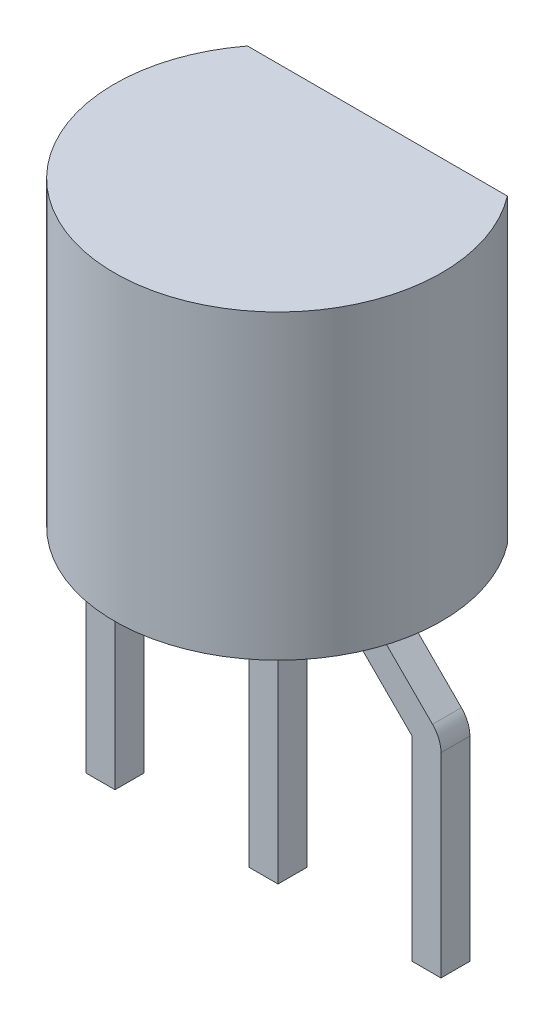
ISO-10303-21;
HEADER;
FILE_DESCRIPTION(('STEP AP214'),'2;1');
FILE_NAME('part.step','',(''),(''),'','','');
FILE_SCHEMA(('AUTOMOTIVE_DESIGN { 1 0 10303 214 1 1 1 1 }'));
ENDSEC;
DATA;
#1=APPLICATION_CONTEXT('core data for automotive mechanical design processes');
#2=APPLICATION_PROTOCOL_DEFINITION('international standard','automotive_design',2000,#1);
#3=PRODUCT_CONTEXT('',#1,'mechanical');
#4=PRODUCT('Part','Part','',(#3));
#5=PRODUCT_RELATED_PRODUCT_CATEGORY('part','',(#4));
#6=PRODUCT_DEFINITION_FORMATION('','',#4);
#7=PRODUCT_DEFINITION_CONTEXT('part definition',#1,'design');
#8=PRODUCT_DEFINITION('design','',#6,#7);
#9=PRODUCT_DEFINITION_SHAPE('','',#8);
#10=(LENGTH_UNIT() NAMED_UNIT(*) SI_UNIT(.MILLI.,.METRE.));
#11=(NAMED_UNIT(*) PLANE_ANGLE_UNIT() SI_UNIT($,.RADIAN.));
#12=(NAMED_UNIT(*) SI_UNIT($,.STERADIAN.) SOLID_ANGLE_UNIT());
#13=UNCERTAINTY_MEASURE_WITH_UNIT(LENGTH_MEASURE(1.E-05),#10,'distance_accuracy_value','');
#14=(GEOMETRIC_REPRESENTATION_CONTEXT(3) GLOBAL_UNCERTAINTY_ASSIGNED_CONTEXT((#13)) GLOBAL_UNIT_ASSIGNED_CONTEXT((#10,
#11,#12)) REPRESENTATION_CONTEXT('',''));
#15=CARTESIAN_POINT('',(0.,0.,0.));
#16=DIRECTION('',(0.,0.,1.));
#17=DIRECTION('',(1.,0.,0.));
#18=AXIS2_PLACEMENT_3D('',#15,#16,#17);
#19=CARTESIAN_POINT('',(0.,0.,0.));
#20=DIRECTION('',(0.,1.,0.));
#21=DIRECTION('',(1.,0.,0.));
#22=AXIS2_PLACEMENT_3D('',#19,#20,#21);
#23=PLANE('',#22);
#24=DIRECTION('',(0.,0.,1.));
#25=VECTOR('',#24,1.);
#26=CARTESIAN_POINT('',(-1.045,0.,0.225));
#27=LINE('',#26,#25);
#28=CARTESIAN_POINT('',(-1.045,0.,-0.225));
#29=VERTEX_POINT('',#28);
#30=CARTESIAN_POINT('',(-1.045,0.,0.225));
#31=VERTEX_POINT('',#30);
#32=EDGE_CURVE('E358',#29,#31,#27,.T.);
#33=ORIENTED_EDGE('',*,*,#32,.F.);
#34=DIRECTION('',(1.,0.,0.));
#35=VECTOR('',#34,1.);
#36=CARTESIAN_POINT('',(-1.495,0.,-0.225));
#37=LINE('',#36,#35);
#38=CARTESIAN_POINT('',(-1.495,0.,-0.225));
#39=VERTEX_POINT('',#38);
#40=EDGE_CURVE('E363',#39,#29,#37,.T.);
#41=ORIENTED_EDGE('',*,*,#40,.F.);
#42=DIRECTION('',(0.,0.,-1.));
#43=VECTOR('',#42,1.);
#44=CARTESIAN_POINT('',(-1.495,0.,0.225));
#45=LINE('',#44,#43);
#46=CARTESIAN_POINT('',(-1.495,0.,0.225));
#47=VERTEX_POINT('',#46);
#48=EDGE_CURVE('E372',#47,#39,#45,.T.);
#49=ORIENTED_EDGE('',*,*,#48,.F.);
#50=DIRECTION('',(-1.,0.,0.));
#51=VECTOR('',#50,1.);
#52=CARTESIAN_POINT('',(-1.495,0.,0.225));
#53=LINE('',#52,#51);
#54=EDGE_CURVE('E369',#31,#47,#53,.T.);
#55=ORIENTED_EDGE('',*,*,#54,.F.);
#56=EDGE_LOOP('',(#33,#41,#49,#55));
#57=FACE_BOUND('',#56,.T.);
#58=DIRECTION('',(1.,0.,0.));
#59=VECTOR('',#58,1.);
#60=CARTESIAN_POINT('',(-5.75142135623731,0.,-1.55));
#61=LINE('',#60,#59);
#62=CARTESIAN_POINT('',(-2.02484567313166,0.,-1.55));
#63=VERTEX_POINT('',#62);
#64=CARTESIAN_POINT('',(2.02484567313166,0.,-1.55));
#65=VERTEX_POINT('',#64);
#66=EDGE_CURVE('E418',#63,#65,#61,.T.);
#67=ORIENTED_EDGE('',*,*,#66,.T.);
#68=CARTESIAN_POINT('',(0.,0.,0.));
#69=DIRECTION('',(0.,1.,0.));
#70=DIRECTION('',(1.,0.,0.));
#71=AXIS2_PLACEMENT_3D('',#68,#69,#70);
#72=CIRCLE('',#71,2.55);
#73=EDGE_CURVE('E38',#63,#65,#72,.T.);
#74=ORIENTED_EDGE('',*,*,#73,.F.);
#75=EDGE_LOOP('',(#67,#74));
#76=FACE_BOUND('',#75,.T.);
#77=DIRECTION('',(0.,0.,1.));
#78=VECTOR('',#77,1.);
#79=CARTESIAN_POINT('',(1.495,0.,0.225));
#80=LINE('',#79,#78);
#81=CARTESIAN_POINT('',(1.495,0.,-0.225));
#82=VERTEX_POINT('',#81);
#83=CARTESIAN_POINT('',(1.495,0.,0.225));
#84=VERTEX_POINT('',#83);
#85=EDGE_CURVE('E388',#82,#84,#80,.T.);
#86=ORIENTED_EDGE('',*,*,#85,.F.);
#87=DIRECTION('',(1.,0.,0.));
#88=VECTOR('',#87,1.);
#89=CARTESIAN_POINT('',(1.045,0.,-0.225));
#90=LINE('',#89,#88);
#91=CARTESIAN_POINT('',(1.045,0.,-0.225));
#92=VERTEX_POINT('',#91);
#93=EDGE_CURVE('E393',#92,#82,#90,.T.);
#94=ORIENTED_EDGE('',*,*,#93,.F.);
#95=DIRECTION('',(0.,0.,-1.));
#96=VECTOR('',#95,1.);
#97=CARTESIAN_POINT('',(1.045,0.,0.225));
#98=LINE('',#97,#96);
#99=CARTESIAN_POINT('',(1.045,0.,0.225));
#100=VERTEX_POINT('',#99);
#101=EDGE_CURVE('E402',#100,#92,#98,.T.);
#102=ORIENTED_EDGE('',*,*,#101,.F.);
#103=DIRECTION('',(-1.,0.,0.));
#104=VECTOR('',#103,1.);
#105=CARTESIAN_POINT('',(1.045,0.,0.225));
#106=LINE('',#105,#104);
#107=EDGE_CURVE('E399',#84,#100,#106,.T.);
#108=ORIENTED_EDGE('',*,*,#107,.F.);
#109=EDGE_LOOP('',(#86,#94,#102,#108));
#110=FACE_BOUND('',#109,.T.);
#111=DIRECTION('',(0.,0.,1.));
#112=VECTOR('',#111,1.);
#113=CARTESIAN_POINT('',(0.225,0.,0.225));
#114=LINE('',#113,#112);
#115=CARTESIAN_POINT('',(0.225,0.,-0.225));
#116=VERTEX_POINT('',#115);
#117=CARTESIAN_POINT('',(0.225,0.,0.225));
#118=VERTEX_POINT('',#117);
#119=EDGE_CURVE('E347',#116,#118,#114,.T.);
#120=ORIENTED_EDGE('',*,*,#119,.F.);
#121=DIRECTION('',(1.,0.,0.));
#122=VECTOR('',#121,1.);
#123=CARTESIAN_POINT('',(-0.225,0.,-0.225));
#124=LINE('',#123,#122);
#125=CARTESIAN_POINT('',(-0.225,0.,-0.225));
#126=VERTEX_POINT('',#125);
#127=EDGE_CURVE('E352',#126,#116,#124,.T.);
#128=ORIENTED_EDGE('',*,*,#127,.F.);
#129=DIRECTION('',(0.,0.,-1.));
#130=VECTOR('',#129,1.);
#131=CARTESIAN_POINT('',(-0.225,0.,0.225));
#132=LINE('',#131,#130);
#133=CARTESIAN_POINT('',(-0.225,0.,0.225));
#134=VERTEX_POINT('',#133);
#135=EDGE_CURVE('E54',#134,#126,#132,.T.);
#136=ORIENTED_EDGE('',*,*,#135,.F.);
#137=DIRECTION('',(-1.,0.,0.));
#138=VECTOR('',#137,1.);
#139=CARTESIAN_POINT('',(-0.225,0.,0.225));
#140=LINE('',#139,#138);
#141=EDGE_CURVE('E49',#118,#134,#140,.T.);
#142=ORIENTED_EDGE('',*,*,#141,.F.);
#143=EDGE_LOOP('',(#120,#128,#136,#142));
#144=FACE_BOUND('',#143,.T.);
#145=ADVANCED_FACE('F34',(#57,#76,#110,#144),#23,.F.);
#146=CARTESIAN_POINT('',(0.,4.7,0.));
#147=DIRECTION('',(0.,-1.,0.));
#148=DIRECTION('',(0.,0.,-1.));
#149=AXIS2_PLACEMENT_3D('',#146,#147,#148);
#150=CYLINDRICAL_SURFACE('',#149,2.55);
#151=DIRECTION('',(0.,-1.,0.));
#152=VECTOR('',#151,1.);
#153=CARTESIAN_POINT('',(2.02484567313166,4.7,-1.55));
#154=LINE('',#153,#152);
#155=CARTESIAN_POINT('',(2.02484567313166,4.7,-1.55));
#156=VERTEX_POINT('',#155);
#157=EDGE_CURVE('E426',#156,#65,#154,.T.);
#158=ORIENTED_EDGE('',*,*,#157,.F.);
#159=CARTESIAN_POINT('',(0.,4.7,0.));
#160=DIRECTION('',(0.,1.,0.));
#161=DIRECTION('',(1.,0.,0.));
#162=AXIS2_PLACEMENT_3D('',#159,#160,#161);
#163=CIRCLE('',#162,2.55);
#164=CARTESIAN_POINT('',(-2.02484567313166,4.7,-1.55));
#165=VERTEX_POINT('',#164);
#166=EDGE_CURVE('E11',#165,#156,#163,.T.);
#167=ORIENTED_EDGE('',*,*,#166,.F.);
#168=DIRECTION('',(0.,-1.,0.));
#169=VECTOR('',#168,1.);
#170=CARTESIAN_POINT('',(-2.02484567313166,4.7,-1.55));
#171=LINE('',#170,#169);
#172=EDGE_CURVE('E421',#165,#63,#171,.T.);
#173=ORIENTED_EDGE('',*,*,#172,.T.);
#174=ORIENTED_EDGE('',*,*,#73,.T.);
#175=EDGE_LOOP('',(#158,#167,#173,#174));
#176=FACE_BOUND('',#175,.T.);
#177=ADVANCED_FACE('F36',(#176),#150,.T.);
#178=CARTESIAN_POINT('',(0.,4.7,0.));
#179=DIRECTION('',(0.,1.,0.));
#180=DIRECTION('',(1.,0.,0.));
#181=AXIS2_PLACEMENT_3D('',#178,#179,#180);
#182=PLANE('',#181);
#183=ORIENTED_EDGE('',*,*,#166,.T.);
#184=DIRECTION('',(1.,0.,0.));
#185=VECTOR('',#184,1.);
#186=CARTESIAN_POINT('',(-5.75142135623731,4.7,-1.55));
#187=LINE('',#186,#185);
#188=EDGE_CURVE('E419',#165,#156,#187,.T.);
#189=ORIENTED_EDGE('',*,*,#188,.F.);
#190=EDGE_LOOP('',(#183,#189));
#191=FACE_BOUND('',#190,.T.);
#192=ADVANCED_FACE('F438',(#191),#182,.T.);
#193=CARTESIAN_POINT('',(-5.75142135623731,4.7,-1.55));
#194=DIRECTION('',(0.,0.,-1.));
#195=DIRECTION('',(-1.,0.,0.));
#196=AXIS2_PLACEMENT_3D('',#193,#194,#195);
#197=PLANE('',#196);
#198=ORIENTED_EDGE('',*,*,#66,.F.);
#199=ORIENTED_EDGE('',*,*,#172,.F.);
#200=ORIENTED_EDGE('',*,*,#188,.T.);
#201=ORIENTED_EDGE('',*,*,#157,.T.);
#202=EDGE_LOOP('',(#198,#199,#200,#201));
#203=FACE_BOUND('',#202,.T.);
#204=ADVANCED_FACE('F435',(#203),#197,.T.);
#205=CARTESIAN_POINT('',(1.495,-0.1,0.225));
#206=DIRECTION('',(-1.,0.,0.));
#207=DIRECTION('',(0.,0.,1.));
#208=AXIS2_PLACEMENT_3D('',#205,#206,#207);
#209=PLANE('',#208);
#210=ORIENTED_EDGE('',*,*,#85,.T.);
#211=DIRECTION('',(0.,1.,0.));
#212=VECTOR('',#211,1.);
#213=CARTESIAN_POINT('',(1.495,-0.1,0.225));
#214=LINE('',#213,#212);
#215=CARTESIAN_POINT('',(1.495,-0.1,0.225));
#216=VERTEX_POINT('',#215);
#217=EDGE_CURVE('E415',#216,#84,#214,.T.);
#218=ORIENTED_EDGE('',*,*,#217,.F.);
#219=DIRECTION('',(0.,0.,1.));
#220=VECTOR('',#219,1.);
#221=CARTESIAN_POINT('',(1.495,-0.1,0.225));
#222=LINE('',#221,#220);
#223=CARTESIAN_POINT('',(1.495,-0.1,-0.225));
#224=VERTEX_POINT('',#223);
#225=EDGE_CURVE('E389',#224,#216,#222,.T.);
#226=ORIENTED_EDGE('',*,*,#225,.F.);
#227=DIRECTION('',(0.,1.,0.));
#228=VECTOR('',#227,1.);
#229=CARTESIAN_POINT('',(1.495,-0.1,-0.225));
#230=LINE('',#229,#228);
#231=EDGE_CURVE('E396',#224,#82,#230,.T.);
#232=ORIENTED_EDGE('',*,*,#231,.T.);
#233=EDGE_LOOP('',(#210,#218,#226,#232));
#234=FACE_BOUND('',#233,.T.);
#235=ADVANCED_FACE('F445',(#234),#209,.F.);
#236=CARTESIAN_POINT('',(1.045,-0.1,0.225));
#237=DIRECTION('',(0.,0.,-1.));
#238=DIRECTION('',(-1.,0.,0.));
#239=AXIS2_PLACEMENT_3D('',#236,#237,#238);
#240=PLANE('',#239);
#241=ORIENTED_EDGE('',*,*,#107,.T.);
#242=DIRECTION('',(0.,1.,0.));
#243=VECTOR('',#242,1.);
#244=CARTESIAN_POINT('',(1.045,-0.1,0.225));
#245=LINE('',#244,#243);
#246=CARTESIAN_POINT('',(1.045,-0.1,0.225));
#247=VERTEX_POINT('',#246);
#248=EDGE_CURVE('E412',#247,#100,#245,.T.);
#249=ORIENTED_EDGE('',*,*,#248,.F.);
#250=CARTESIAN_POINT('',(1.495,-0.1,0.225));
#251=DIRECTION('',(0.,0.,-1.));
#252=DIRECTION('',(-1.,0.,0.));
#253=AXIS2_PLACEMENT_3D('',#250,#251,#252);
#254=CIRCLE('',#253,0.45);
#255=CARTESIAN_POINT('',(1.17680194846605,-0.418198051533947,0.225));
#256=VERTEX_POINT('',#255);
#257=EDGE_CURVE('E284',#256,#247,#254,.T.);
#258=ORIENTED_EDGE('',*,*,#257,.F.);
#259=DIRECTION('',(-0.707106781186549,0.707106781186546,0.));
#260=VECTOR('',#259,1.);
#261=CARTESIAN_POINT('',(2.3152438661764,-1.55663996924429,0.225));
#262=LINE('',#261,#260);
#263=CARTESIAN_POINT('',(2.3152438661764,-1.55663996924429,0.225));
#264=VERTEX_POINT('',#263);
#265=EDGE_CURVE('E278',#264,#256,#262,.T.);
#266=ORIENTED_EDGE('',*,*,#265,.F.);
#267=DIRECTION('',(0.,1.,0.));
#268=VECTOR('',#267,1.);
#269=CARTESIAN_POINT('',(2.3152438661764,-4.59663996924429,0.225));
#270=LINE('',#269,#268);
#271=CARTESIAN_POINT('',(2.3152438661764,-4.59663996924429,0.225));
#272=VERTEX_POINT('',#271);
#273=EDGE_CURVE('E242',#272,#264,#270,.T.);
#274=ORIENTED_EDGE('',*,*,#273,.F.);
#275=DIRECTION('',(-1.,0.,0.));
#276=VECTOR('',#275,1.);
#277=CARTESIAN_POINT('',(2.3152438661764,-4.59663996924429,0.225));
#278=LINE('',#277,#276);
#279=CARTESIAN_POINT('',(2.7652438661764,-4.59663996924429,0.225));
#280=VERTEX_POINT('',#279);
#281=EDGE_CURVE('E240',#280,#272,#278,.T.);
#282=ORIENTED_EDGE('',*,*,#281,.F.);
#283=DIRECTION('',(0.,1.,0.));
#284=VECTOR('',#283,1.);
#285=CARTESIAN_POINT('',(2.7652438661764,-4.59663996924429,0.225));
#286=LINE('',#285,#284);
#287=CARTESIAN_POINT('',(2.7652438661764,-1.55663996924429,0.225));
#288=VERTEX_POINT('',#287);
#289=EDGE_CURVE('E245',#280,#288,#286,.T.);
#290=ORIENTED_EDGE('',*,*,#289,.T.);
#291=CARTESIAN_POINT('',(2.3152438661764,-1.55663996924429,0.225));
#292=DIRECTION('',(0.,0.,1.));
#293=DIRECTION('',(1.,0.,0.));
#294=AXIS2_PLACEMENT_3D('',#291,#292,#293);
#295=CIRCLE('',#294,0.45);
#296=CARTESIAN_POINT('',(2.63344191771034,-1.23844191771034,0.225));
#297=VERTEX_POINT('',#296);
#298=EDGE_CURVE('E257',#288,#297,#295,.T.);
#299=ORIENTED_EDGE('',*,*,#298,.T.);
#300=DIRECTION('',(-0.707106781186549,0.707106781186546,0.));
#301=VECTOR('',#300,1.);
#302=CARTESIAN_POINT('',(2.63344191771034,-1.23844191771034,0.225));
#303=LINE('',#302,#301);
#304=EDGE_CURVE('E269',#297,#216,#303,.T.);
#305=ORIENTED_EDGE('',*,*,#304,.T.);
#306=ORIENTED_EDGE('',*,*,#217,.T.);
#307=EDGE_LOOP('',(#241,#249,#258,#266,#274,#282,#290,#299,#305,#306));
#308=FACE_BOUND('',#307,.T.);
#309=ADVANCED_FACE('F523',(#308),#240,.F.);
#310=CARTESIAN_POINT('',(1.045,-0.1,0.225));
#311=DIRECTION('',(1.,0.,0.));
#312=DIRECTION('',(0.,0.,-1.));
#313=AXIS2_PLACEMENT_3D('',#310,#311,#312);
#314=PLANE('',#313);
#315=ORIENTED_EDGE('',*,*,#101,.T.);
#316=DIRECTION('',(0.,1.,0.));
#317=VECTOR('',#316,1.);
#318=CARTESIAN_POINT('',(1.045,-0.1,-0.225));
#319=LINE('',#318,#317);
#320=CARTESIAN_POINT('',(1.045,-0.1,-0.225));
#321=VERTEX_POINT('',#320);
#322=EDGE_CURVE('E409',#321,#92,#319,.T.);
#323=ORIENTED_EDGE('',*,*,#322,.F.);
#324=DIRECTION('',(0.,0.,-1.));
#325=VECTOR('',#324,1.);
#326=CARTESIAN_POINT('',(1.045,-0.1,0.225));
#327=LINE('',#326,#325);
#328=EDGE_CURVE('E392',#247,#321,#327,.T.);
#329=ORIENTED_EDGE('',*,*,#328,.F.);
#330=ORIENTED_EDGE('',*,*,#248,.T.);
#331=EDGE_LOOP('',(#315,#323,#329,#330));
#332=FACE_BOUND('',#331,.T.);
#333=ADVANCED_FACE('F519',(#332),#314,.F.);
#334=CARTESIAN_POINT('',(1.045,-0.1,-0.225));
#335=DIRECTION('',(0.,0.,1.));
#336=DIRECTION('',(1.,0.,0.));
#337=AXIS2_PLACEMENT_3D('',#334,#335,#336);
#338=PLANE('',#337);
#339=ORIENTED_EDGE('',*,*,#93,.T.);
#340=ORIENTED_EDGE('',*,*,#231,.F.);
#341=DIRECTION('',(-0.707106781186549,0.707106781186546,0.));
#342=VECTOR('',#341,1.);
#343=CARTESIAN_POINT('',(2.63344191771034,-1.23844191771034,-0.225));
#344=LINE('',#343,#342);
#345=CARTESIAN_POINT('',(2.63344191771034,-1.23844191771034,-0.225));
#346=VERTEX_POINT('',#345);
#347=EDGE_CURVE('E272',#346,#224,#344,.T.);
#348=ORIENTED_EDGE('',*,*,#347,.F.);
#349=CARTESIAN_POINT('',(2.3152438661764,-1.55663996924429,-0.225));
#350=DIRECTION('',(0.,0.,1.));
#351=DIRECTION('',(1.,0.,0.));
#352=AXIS2_PLACEMENT_3D('',#349,#350,#351);
#353=CIRCLE('',#352,0.45);
#354=CARTESIAN_POINT('',(2.7652438661764,-1.55663996924429,-0.225));
#355=VERTEX_POINT('',#354);
#356=EDGE_CURVE('E260',#355,#346,#353,.T.);
#357=ORIENTED_EDGE('',*,*,#356,.F.);
#358=DIRECTION('',(0.,1.,0.));
#359=VECTOR('',#358,1.);
#360=CARTESIAN_POINT('',(2.7652438661764,-4.59663996924429,-0.225));
#361=LINE('',#360,#359);
#362=CARTESIAN_POINT('',(2.7652438661764,-4.59663996924429,-0.225));
#363=VERTEX_POINT('',#362);
#364=EDGE_CURVE('E248',#363,#355,#361,.T.);
#365=ORIENTED_EDGE('',*,*,#364,.F.);
#366=DIRECTION('',(1.,0.,0.));
#367=VECTOR('',#366,1.);
#368=CARTESIAN_POINT('',(2.3152438661764,-4.59663996924429,-0.225000000000001));
#369=LINE('',#368,#367);
#370=CARTESIAN_POINT('',(2.3152438661764,-4.59663996924429,-0.225000000000001));
#371=VERTEX_POINT('',#370);
#372=EDGE_CURVE('E236',#371,#363,#369,.T.);
#373=ORIENTED_EDGE('',*,*,#372,.F.);
#374=DIRECTION('',(0.,1.,0.));
#375=VECTOR('',#374,1.);
#376=CARTESIAN_POINT('',(2.3152438661764,-4.59663996924429,-0.225000000000001));
#377=LINE('',#376,#375);
#378=CARTESIAN_POINT('',(2.3152438661764,-1.55663996924429,-0.225));
#379=VERTEX_POINT('',#378);
#380=EDGE_CURVE('E251',#371,#379,#377,.T.);
#381=ORIENTED_EDGE('',*,*,#380,.T.);
#382=DIRECTION('',(-0.707106781186549,0.707106781186546,0.));
#383=VECTOR('',#382,1.);
#384=CARTESIAN_POINT('',(2.3152438661764,-1.55663996924429,-0.225));
#385=LINE('',#384,#383);
#386=CARTESIAN_POINT('',(1.17680194846605,-0.418198051533947,-0.225));
#387=VERTEX_POINT('',#386);
#388=EDGE_CURVE('E275',#379,#387,#385,.T.);
#389=ORIENTED_EDGE('',*,*,#388,.T.);
#390=CARTESIAN_POINT('',(1.495,-0.1,-0.225));
#391=DIRECTION('',(0.,0.,-1.));
#392=DIRECTION('',(-1.,0.,0.));
#393=AXIS2_PLACEMENT_3D('',#390,#391,#392);
#394=CIRCLE('',#393,0.45);
#395=EDGE_CURVE('E287',#387,#321,#394,.T.);
#396=ORIENTED_EDGE('',*,*,#395,.T.);
#397=ORIENTED_EDGE('',*,*,#322,.T.);
#398=EDGE_LOOP('',(#339,#340,#348,#357,#365,#373,#381,#389,#396,#397));
#399=FACE_BOUND('',#398,.T.);
#400=ADVANCED_FACE('F516',(#399),#338,.F.);
#401=CARTESIAN_POINT('',(-1.045,-0.1,0.225));
#402=DIRECTION('',(-1.,0.,0.));
#403=DIRECTION('',(0.,0.,1.));
#404=AXIS2_PLACEMENT_3D('',#401,#402,#403);
#405=PLANE('',#404);
#406=ORIENTED_EDGE('',*,*,#32,.T.);
#407=DIRECTION('',(0.,1.,0.));
#408=VECTOR('',#407,1.);
#409=CARTESIAN_POINT('',(-1.045,-0.1,0.225));
#410=LINE('',#409,#408);
#411=CARTESIAN_POINT('',(-1.045,-0.1,0.225));
#412=VERTEX_POINT('',#411);
#413=EDGE_CURVE('E385',#412,#31,#410,.T.);
#414=ORIENTED_EDGE('',*,*,#413,.F.);
#415=DIRECTION('',(0.,0.,1.));
#416=VECTOR('',#415,1.);
#417=CARTESIAN_POINT('',(-1.045,-0.1,0.225));
#418=LINE('',#417,#416);
#419=CARTESIAN_POINT('',(-1.045,-0.1,-0.225));
#420=VERTEX_POINT('',#419);
#421=EDGE_CURVE('E359',#420,#412,#418,.T.);
#422=ORIENTED_EDGE('',*,*,#421,.F.);
#423=DIRECTION('',(0.,1.,0.));
#424=VECTOR('',#423,1.);
#425=CARTESIAN_POINT('',(-1.045,-0.1,-0.225));
#426=LINE('',#425,#424);
#427=EDGE_CURVE('E366',#420,#29,#426,.T.);
#428=ORIENTED_EDGE('',*,*,#427,.T.);
#429=EDGE_LOOP('',(#406,#414,#422,#428));
#430=FACE_BOUND('',#429,.T.);
#431=ADVANCED_FACE('F455',(#430),#405,.F.);
#432=CARTESIAN_POINT('',(-1.495,-0.1,0.225));
#433=DIRECTION('',(0.,0.,-1.));
#434=DIRECTION('',(-1.,0.,0.));
#435=AXIS2_PLACEMENT_3D('',#432,#433,#434);
#436=PLANE('',#435);
#437=ORIENTED_EDGE('',*,*,#54,.T.);
#438=DIRECTION('',(0.,1.,0.));
#439=VECTOR('',#438,1.);
#440=CARTESIAN_POINT('',(-1.495,-0.1,0.225));
#441=LINE('',#440,#439);
#442=CARTESIAN_POINT('',(-1.495,-0.1,0.225));
#443=VERTEX_POINT('',#442);
#444=EDGE_CURVE('E382',#443,#47,#441,.T.);
#445=ORIENTED_EDGE('',*,*,#444,.F.);
#446=DIRECTION('',(0.707106781186549,0.707106781186546,0.));
#447=VECTOR('',#446,1.);
#448=CARTESIAN_POINT('',(-2.63344191771034,-1.23844191771034,0.225));
#449=LINE('',#448,#447);
#450=CARTESIAN_POINT('',(-2.63344191771034,-1.23844191771034,0.225));
#451=VERTEX_POINT('',#450);
#452=EDGE_CURVE('E329',#451,#443,#449,.T.);
#453=ORIENTED_EDGE('',*,*,#452,.F.);
#454=CARTESIAN_POINT('',(-2.3152438661764,-1.55663996924429,0.225));
#455=DIRECTION('',(0.,0.,-1.));
#456=DIRECTION('',(-1.,0.,0.));
#457=AXIS2_PLACEMENT_3D('',#454,#455,#456);
#458=CIRCLE('',#457,0.45);
#459=CARTESIAN_POINT('',(-2.7652438661764,-1.55663996924429,0.225));
#460=VERTEX_POINT('',#459);
#461=EDGE_CURVE('E317',#460,#451,#458,.T.);
#462=ORIENTED_EDGE('',*,*,#461,.F.);
#463=DIRECTION('',(0.,1.,0.));
#464=VECTOR('',#463,1.);
#465=CARTESIAN_POINT('',(-2.7652438661764,-4.59663996924429,0.225));
#466=LINE('',#465,#464);
#467=CARTESIAN_POINT('',(-2.7652438661764,-4.59663996924429,0.225));
#468=VERTEX_POINT('',#467);
#469=EDGE_CURVE('E299',#468,#460,#466,.T.);
#470=ORIENTED_EDGE('',*,*,#469,.F.);
#471=DIRECTION('',(-1.,0.,0.));
#472=VECTOR('',#471,1.);
#473=CARTESIAN_POINT('',(-2.7652438661764,-4.59663996924429,0.225));
#474=LINE('',#473,#472);
#475=CARTESIAN_POINT('',(-2.3152438661764,-4.59663996924429,0.225));
#476=VERTEX_POINT('',#475);
#477=EDGE_CURVE('E297',#476,#468,#474,.T.);
#478=ORIENTED_EDGE('',*,*,#477,.F.);
#479=DIRECTION('',(0.,1.,0.));
#480=VECTOR('',#479,1.);
#481=CARTESIAN_POINT('',(-2.3152438661764,-4.59663996924429,0.225));
#482=LINE('',#481,#480);
#483=CARTESIAN_POINT('',(-2.3152438661764,-1.55663996924429,0.225));
#484=VERTEX_POINT('',#483);
#485=EDGE_CURVE('E302',#476,#484,#482,.T.);
#486=ORIENTED_EDGE('',*,*,#485,.T.);
#487=DIRECTION('',(0.707106781186549,0.707106781186546,0.));
#488=VECTOR('',#487,1.);
#489=CARTESIAN_POINT('',(-2.3152438661764,-1.55663996924429,0.225));
#490=LINE('',#489,#488);
#491=CARTESIAN_POINT('',(-1.17680194846605,-0.418198051533947,0.225));
#492=VERTEX_POINT('',#491);
#493=EDGE_CURVE('E332',#484,#492,#490,.T.);
#494=ORIENTED_EDGE('',*,*,#493,.T.);
#495=CARTESIAN_POINT('',(-1.495,-0.1,0.225));
#496=DIRECTION('',(0.,0.,1.));
#497=DIRECTION('',(1.,0.,0.));
#498=AXIS2_PLACEMENT_3D('',#495,#496,#497);
#499=CIRCLE('',#498,0.45);
#500=EDGE_CURVE('E341',#492,#412,#499,.T.);
#501=ORIENTED_EDGE('',*,*,#500,.T.);
#502=ORIENTED_EDGE('',*,*,#413,.T.);
#503=EDGE_LOOP('',(#437,#445,#453,#462,#470,#478,#486,#494,#501,#502));
#504=FACE_BOUND('',#503,.T.);
#505=ADVANCED_FACE('F484',(#504),#436,.F.);
#506=CARTESIAN_POINT('',(-1.495,-0.1,0.225));
#507=DIRECTION('',(1.,0.,0.));
#508=DIRECTION('',(0.,0.,-1.));
#509=AXIS2_PLACEMENT_3D('',#506,#507,#508);
#510=PLANE('',#509);
#511=ORIENTED_EDGE('',*,*,#48,.T.);
#512=DIRECTION('',(0.,1.,0.));
#513=VECTOR('',#512,1.);
#514=CARTESIAN_POINT('',(-1.495,-0.1,-0.225));
#515=LINE('',#514,#513);
#516=CARTESIAN_POINT('',(-1.495,-0.1,-0.225));
#517=VERTEX_POINT('',#516);
#518=EDGE_CURVE('E379',#517,#39,#515,.T.);
#519=ORIENTED_EDGE('',*,*,#518,.F.);
#520=DIRECTION('',(0.,0.,-1.));
#521=VECTOR('',#520,1.);
#522=CARTESIAN_POINT('',(-1.495,-0.1,0.225));
#523=LINE('',#522,#521);
#524=EDGE_CURVE('E362',#443,#517,#523,.T.);
#525=ORIENTED_EDGE('',*,*,#524,.F.);
#526=ORIENTED_EDGE('',*,*,#444,.T.);
#527=EDGE_LOOP('',(#511,#519,#525,#526));
#528=FACE_BOUND('',#527,.T.);
#529=ADVANCED_FACE('F482',(#528),#510,.F.);
#530=CARTESIAN_POINT('',(-1.495,-0.1,-0.225));
#531=DIRECTION('',(0.,0.,1.));
#532=DIRECTION('',(1.,0.,0.));
#533=AXIS2_PLACEMENT_3D('',#530,#531,#532);
#534=PLANE('',#533);
#535=ORIENTED_EDGE('',*,*,#40,.T.);
#536=ORIENTED_EDGE('',*,*,#427,.F.);
#537=CARTESIAN_POINT('',(-1.495,-0.1,-0.225));
#538=DIRECTION('',(0.,0.,1.));
#539=DIRECTION('',(1.,0.,0.));
#540=AXIS2_PLACEMENT_3D('',#537,#538,#539);
#541=CIRCLE('',#540,0.45);
#542=CARTESIAN_POINT('',(-1.17680194846605,-0.418198051533947,-0.225));
#543=VERTEX_POINT('',#542);
#544=EDGE_CURVE('E344',#543,#420,#541,.T.);
#545=ORIENTED_EDGE('',*,*,#544,.F.);
#546=DIRECTION('',(0.707106781186549,0.707106781186546,0.));
#547=VECTOR('',#546,1.);
#548=CARTESIAN_POINT('',(-2.3152438661764,-1.55663996924429,-0.225));
#549=LINE('',#548,#547);
#550=CARTESIAN_POINT('',(-2.3152438661764,-1.55663996924429,-0.225));
#551=VERTEX_POINT('',#550);
#552=EDGE_CURVE('E335',#551,#543,#549,.T.);
#553=ORIENTED_EDGE('',*,*,#552,.F.);
#554=DIRECTION('',(0.,1.,0.));
#555=VECTOR('',#554,1.);
#556=CARTESIAN_POINT('',(-2.3152438661764,-4.59663996924429,-0.225));
#557=LINE('',#556,#555);
#558=CARTESIAN_POINT('',(-2.3152438661764,-4.59663996924429,-0.225));
#559=VERTEX_POINT('',#558);
#560=EDGE_CURVE('E305',#559,#551,#557,.T.);
#561=ORIENTED_EDGE('',*,*,#560,.F.);
#562=DIRECTION('',(1.,0.,0.));
#563=VECTOR('',#562,1.);
#564=CARTESIAN_POINT('',(-2.7652438661764,-4.59663996924429,-0.225));
#565=LINE('',#564,#563);
#566=CARTESIAN_POINT('',(-2.7652438661764,-4.59663996924429,-0.225));
#567=VERTEX_POINT('',#566);
#568=EDGE_CURVE('E293',#567,#559,#565,.T.);
#569=ORIENTED_EDGE('',*,*,#568,.F.);
#570=DIRECTION('',(0.,1.,0.));
#571=VECTOR('',#570,1.);
#572=CARTESIAN_POINT('',(-2.7652438661764,-4.59663996924429,-0.225));
#573=LINE('',#572,#571);
#574=CARTESIAN_POINT('',(-2.7652438661764,-1.55663996924429,-0.225));
#575=VERTEX_POINT('',#574);
#576=EDGE_CURVE('E308',#567,#575,#573,.T.);
#577=ORIENTED_EDGE('',*,*,#576,.T.);
#578=CARTESIAN_POINT('',(-2.3152438661764,-1.55663996924429,-0.225));
#579=DIRECTION('',(0.,0.,-1.));
#580=DIRECTION('',(-1.,0.,0.));
#581=AXIS2_PLACEMENT_3D('',#578,#579,#580);
#582=CIRCLE('',#581,0.45);
#583=CARTESIAN_POINT('',(-2.63344191771034,-1.23844191771034,-0.225));
#584=VERTEX_POINT('',#583);
#585=EDGE_CURVE('E314',#575,#584,#582,.T.);
#586=ORIENTED_EDGE('',*,*,#585,.T.);
#587=DIRECTION('',(0.707106781186549,0.707106781186546,0.));
#588=VECTOR('',#587,1.);
#589=CARTESIAN_POINT('',(-2.63344191771034,-1.23844191771034,-0.225));
#590=LINE('',#589,#588);
#591=EDGE_CURVE('E326',#584,#517,#590,.T.);
#592=ORIENTED_EDGE('',*,*,#591,.T.);
#593=ORIENTED_EDGE('',*,*,#518,.T.);
#594=EDGE_LOOP('',(#535,#536,#545,#553,#561,#569,#577,#586,#592,#593));
#595=FACE_BOUND('',#594,.T.);
#596=ADVANCED_FACE('F454',(#595),#534,.F.);
#597=CARTESIAN_POINT('',(0.225,-1.59863016228097,0.225));
#598=DIRECTION('',(-1.,0.,0.));
#599=DIRECTION('',(0.,0.,1.));
#600=AXIS2_PLACEMENT_3D('',#597,#598,#599);
#601=PLANE('',#600);
#602=ORIENTED_EDGE('',*,*,#119,.T.);
#603=DIRECTION('',(0.,1.,0.));
#604=VECTOR('',#603,1.);
#605=CARTESIAN_POINT('',(0.225,-1.59863016228097,0.225));
#606=LINE('',#605,#604);
#607=CARTESIAN_POINT('',(0.225,-4.59863016228097,0.225));
#608=VERTEX_POINT('',#607);
#609=EDGE_CURVE('E356',#608,#118,#606,.T.);
#610=ORIENTED_EDGE('',*,*,#609,.F.);
#611=DIRECTION('',(0.,0.,1.));
#612=VECTOR('',#611,1.);
#613=CARTESIAN_POINT('',(0.225,-4.59863016228097,0.225));
#614=LINE('',#613,#612);
#615=CARTESIAN_POINT('',(0.225,-4.59863016228097,-0.225));
#616=VERTEX_POINT('',#615);
#617=EDGE_CURVE('E223',#616,#608,#614,.T.);
#618=ORIENTED_EDGE('',*,*,#617,.F.);
#619=DIRECTION('',(0.,1.,0.));
#620=VECTOR('',#619,1.);
#621=CARTESIAN_POINT('',(0.225,-1.59863016228097,-0.225));
#622=LINE('',#621,#620);
#623=EDGE_CURVE('E214',#616,#116,#622,.T.);
#624=ORIENTED_EDGE('',*,*,#623,.T.);
#625=EDGE_LOOP('',(#602,#610,#618,#624));
#626=FACE_BOUND('',#625,.T.);
#627=ADVANCED_FACE('F503',(#626),#601,.F.);
#628=CARTESIAN_POINT('',(-0.225,-1.59863016228097,0.225));
#629=DIRECTION('',(0.,0.,-1.));
#630=DIRECTION('',(-1.,0.,0.));
#631=AXIS2_PLACEMENT_3D('',#628,#629,#630);
#632=PLANE('',#631);
#633=ORIENTED_EDGE('',*,*,#141,.T.);
#634=DIRECTION('',(0.,1.,0.));
#635=VECTOR('',#634,1.);
#636=CARTESIAN_POINT('',(-0.225,-1.59863016228097,0.225));
#637=LINE('',#636,#635);
#638=CARTESIAN_POINT('',(-0.225,-4.59863016228097,0.225));
#639=VERTEX_POINT('',#638);
#640=EDGE_CURVE('E213',#639,#134,#637,.T.);
#641=ORIENTED_EDGE('',*,*,#640,.F.);
#642=DIRECTION('',(-1.,0.,0.));
#643=VECTOR('',#642,1.);
#644=CARTESIAN_POINT('',(-0.225,-4.59863016228097,0.225));
#645=LINE('',#644,#643);
#646=EDGE_CURVE('E228',#608,#639,#645,.T.);
#647=ORIENTED_EDGE('',*,*,#646,.F.);
#648=ORIENTED_EDGE('',*,*,#609,.T.);
#649=EDGE_LOOP('',(#633,#641,#647,#648));
#650=FACE_BOUND('',#649,.T.);
#651=ADVANCED_FACE('F500',(#650),#632,.F.);
#652=CARTESIAN_POINT('',(-0.225,-1.59863016228097,0.225));
#653=DIRECTION('',(1.,0.,0.));
#654=DIRECTION('',(0.,0.,-1.));
#655=AXIS2_PLACEMENT_3D('',#652,#653,#654);
#656=PLANE('',#655);
#657=ORIENTED_EDGE('',*,*,#135,.T.);
#658=DIRECTION('',(0.,1.,0.));
#659=VECTOR('',#658,1.);
#660=CARTESIAN_POINT('',(-0.225,-1.59863016228097,-0.225));
#661=LINE('',#660,#659);
#662=CARTESIAN_POINT('',(-0.225,-4.59863016228097,-0.225));
#663=VERTEX_POINT('',#662);
#664=EDGE_CURVE('E205',#663,#126,#661,.T.);
#665=ORIENTED_EDGE('',*,*,#664,.F.);
#666=DIRECTION('',(0.,0.,-1.));
#667=VECTOR('',#666,1.);
#668=CARTESIAN_POINT('',(-0.225,-4.59863016228097,0.225));
#669=LINE('',#668,#667);
#670=EDGE_CURVE('E210',#639,#663,#669,.T.);
#671=ORIENTED_EDGE('',*,*,#670,.F.);
#672=ORIENTED_EDGE('',*,*,#640,.T.);
#673=EDGE_LOOP('',(#657,#665,#671,#672));
#674=FACE_BOUND('',#673,.T.);
#675=ADVANCED_FACE('F207',(#674),#656,.F.);
#676=CARTESIAN_POINT('',(-0.225,-1.59863016228097,-0.225));
#677=DIRECTION('',(0.,0.,1.));
#678=DIRECTION('',(1.,0.,0.));
#679=AXIS2_PLACEMENT_3D('',#676,#677,#678);
#680=PLANE('',#679);
#681=ORIENTED_EDGE('',*,*,#127,.T.);
#682=ORIENTED_EDGE('',*,*,#623,.F.);
#683=DIRECTION('',(1.,0.,0.));
#684=VECTOR('',#683,1.);
#685=CARTESIAN_POINT('',(-0.225,-4.59863016228097,-0.225));
#686=LINE('',#685,#684);
#687=EDGE_CURVE('E217',#663,#616,#686,.T.);
#688=ORIENTED_EDGE('',*,*,#687,.F.);
#689=ORIENTED_EDGE('',*,*,#664,.T.);
#690=EDGE_LOOP('',(#681,#682,#688,#689));
#691=FACE_BOUND('',#690,.T.);
#692=ADVANCED_FACE('F218',(#691),#680,.F.);
#693=CARTESIAN_POINT('',(-1.495,-0.1,0.225));
#694=DIRECTION('',(0.,0.,1.));
#695=DIRECTION('',(1.,0.,0.));
#696=AXIS2_PLACEMENT_3D('',#693,#694,#695);
#697=CYLINDRICAL_SURFACE('',#696,0.45);
#698=ORIENTED_EDGE('',*,*,#500,.F.);
#699=DIRECTION('',(0.,0.,1.));
#700=VECTOR('',#699,1.);
#701=CARTESIAN_POINT('',(-1.17680194846605,-0.418198051533947,0.225));
#702=LINE('',#701,#700);
#703=EDGE_CURVE('E338',#543,#492,#702,.T.);
#704=ORIENTED_EDGE('',*,*,#703,.F.);
#705=ORIENTED_EDGE('',*,*,#544,.T.);
#706=ORIENTED_EDGE('',*,*,#421,.T.);
#707=EDGE_LOOP('',(#698,#704,#705,#706));
#708=FACE_BOUND('',#707,.T.);
#709=ADVANCED_FACE('F457',(#708),#697,.T.);
#710=CARTESIAN_POINT('',(-2.3152438661764,-1.55663996924429,-0.225));
#711=DIRECTION('',(-0.707106781186546,0.707106781186549,0.));
#712=DIRECTION('',(-0.707106781186549,-0.707106781186546,0.));
#713=AXIS2_PLACEMENT_3D('',#710,#711,#712);
#714=PLANE('',#713);
#715=ORIENTED_EDGE('',*,*,#703,.T.);
#716=ORIENTED_EDGE('',*,*,#493,.F.);
#717=DIRECTION('',(0.,0.,1.));
#718=VECTOR('',#717,1.);
#719=CARTESIAN_POINT('',(-2.3152438661764,-1.55663996924429,-0.225));
#720=LINE('',#719,#718);
#721=EDGE_CURVE('E320',#551,#484,#720,.T.);
#722=ORIENTED_EDGE('',*,*,#721,.F.);
#723=ORIENTED_EDGE('',*,*,#552,.T.);
#724=EDGE_LOOP('',(#715,#716,#722,#723));
#725=FACE_BOUND('',#724,.T.);
#726=ADVANCED_FACE('F485',(#725),#714,.F.);
#727=CARTESIAN_POINT('',(-2.63344191771034,-1.23844191771034,-0.225));
#728=DIRECTION('',(0.707106781186546,-0.707106781186549,0.));
#729=DIRECTION('',(0.707106781186549,0.707106781186546,0.));
#730=AXIS2_PLACEMENT_3D('',#727,#728,#729);
#731=PLANE('',#730);
#732=ORIENTED_EDGE('',*,*,#524,.T.);
#733=ORIENTED_EDGE('',*,*,#591,.F.);
#734=DIRECTION('',(0.,0.,-1.));
#735=VECTOR('',#734,1.);
#736=CARTESIAN_POINT('',(-2.63344191771034,-1.23844191771034,-0.225));
#737=LINE('',#736,#735);
#738=EDGE_CURVE('E323',#451,#584,#737,.T.);
#739=ORIENTED_EDGE('',*,*,#738,.F.);
#740=ORIENTED_EDGE('',*,*,#452,.T.);
#741=EDGE_LOOP('',(#732,#733,#739,#740));
#742=FACE_BOUND('',#741,.T.);
#743=ADVANCED_FACE('F479',(#742),#731,.F.);
#744=CARTESIAN_POINT('',(-2.3152438661764,-1.55663996924429,-0.225));
#745=DIRECTION('',(0.,0.,-1.));
#746=DIRECTION('',(-1.,0.,0.));
#747=AXIS2_PLACEMENT_3D('',#744,#745,#746);
#748=CYLINDRICAL_SURFACE('',#747,0.45);
#749=DIRECTION('',(0.,0.,-1.));
#750=VECTOR('',#749,1.);
#751=CARTESIAN_POINT('',(-2.7652438661764,-1.55663996924429,-0.225));
#752=LINE('',#751,#750);
#753=EDGE_CURVE('E311',#460,#575,#752,.T.);
#754=ORIENTED_EDGE('',*,*,#753,.F.);
#755=ORIENTED_EDGE('',*,*,#461,.T.);
#756=ORIENTED_EDGE('',*,*,#738,.T.);
#757=ORIENTED_EDGE('',*,*,#585,.F.);
#758=EDGE_LOOP('',(#754,#755,#756,#757));
#759=FACE_BOUND('',#758,.T.);
#760=ADVANCED_FACE('F476',(#759),#748,.T.);
#761=CARTESIAN_POINT('',(-2.7652438661764,-4.59663996924429,0.225));
#762=DIRECTION('',(1.,0.,0.));
#763=DIRECTION('',(0.,1.,0.));
#764=AXIS2_PLACEMENT_3D('',#761,#762,#763);
#765=PLANE('',#764);
#766=ORIENTED_EDGE('',*,*,#753,.T.);
#767=ORIENTED_EDGE('',*,*,#576,.F.);
#768=DIRECTION('',(0.,0.,-1.));
#769=VECTOR('',#768,1.);
#770=CARTESIAN_POINT('',(-2.7652438661764,-4.59663996924429,0.225));
#771=LINE('',#770,#769);
#772=EDGE_CURVE('E290',#468,#567,#771,.T.);
#773=ORIENTED_EDGE('',*,*,#772,.F.);
#774=ORIENTED_EDGE('',*,*,#469,.T.);
#775=EDGE_LOOP('',(#766,#767,#773,#774));
#776=FACE_BOUND('',#775,.T.);
#777=ADVANCED_FACE('F474',(#776),#765,.F.);
#778=CARTESIAN_POINT('',(-2.3152438661764,-4.59663996924429,0.225));
#779=DIRECTION('',(-1.,0.,0.));
#780=DIRECTION('',(0.,-1.,0.));
#781=AXIS2_PLACEMENT_3D('',#778,#779,#780);
#782=PLANE('',#781);
#783=ORIENTED_EDGE('',*,*,#721,.T.);
#784=ORIENTED_EDGE('',*,*,#485,.F.);
#785=DIRECTION('',(0.,0.,1.));
#786=VECTOR('',#785,1.);
#787=CARTESIAN_POINT('',(-2.3152438661764,-4.59663996924429,0.225));
#788=LINE('',#787,#786);
#789=EDGE_CURVE('E295',#559,#476,#788,.T.);
#790=ORIENTED_EDGE('',*,*,#789,.F.);
#791=ORIENTED_EDGE('',*,*,#560,.T.);
#792=EDGE_LOOP('',(#783,#784,#790,#791));
#793=FACE_BOUND('',#792,.T.);
#794=ADVANCED_FACE('F464',(#793),#782,.F.);
#795=CARTESIAN_POINT('',(-2.7652438661764,-4.59663996924429,-0.225));
#796=DIRECTION('',(0.,-1.,0.));
#797=DIRECTION('',(1.,0.,0.));
#798=AXIS2_PLACEMENT_3D('',#795,#796,#797);
#799=PLANE('',#798);
#800=ORIENTED_EDGE('',*,*,#772,.T.);
#801=ORIENTED_EDGE('',*,*,#568,.T.);
#802=ORIENTED_EDGE('',*,*,#789,.T.);
#803=ORIENTED_EDGE('',*,*,#477,.T.);
#804=EDGE_LOOP('',(#800,#801,#802,#803));
#805=FACE_BOUND('',#804,.T.);
#806=ADVANCED_FACE('F468',(#805),#799,.T.);
#807=CARTESIAN_POINT('',(1.495,-0.1,0.225));
#808=DIRECTION('',(0.,0.,-1.));
#809=DIRECTION('',(-1.,0.,0.));
#810=AXIS2_PLACEMENT_3D('',#807,#808,#809);
#811=CYLINDRICAL_SURFACE('',#810,0.45);
#812=ORIENTED_EDGE('',*,*,#395,.F.);
#813=DIRECTION('',(0.,0.,-1.));
#814=VECTOR('',#813,1.);
#815=CARTESIAN_POINT('',(1.17680194846605,-0.418198051533947,0.225));
#816=LINE('',#815,#814);
#817=EDGE_CURVE('E281',#256,#387,#816,.T.);
#818=ORIENTED_EDGE('',*,*,#817,.F.);
#819=ORIENTED_EDGE('',*,*,#257,.T.);
#820=ORIENTED_EDGE('',*,*,#328,.T.);
#821=EDGE_LOOP('',(#812,#818,#819,#820));
#822=FACE_BOUND('',#821,.T.);
#823=ADVANCED_FACE('F558',(#822),#811,.T.);
#824=CARTESIAN_POINT('',(2.3152438661764,-1.55663996924429,0.225));
#825=DIRECTION('',(0.707106781186546,0.707106781186549,0.));
#826=DIRECTION('',(-0.707106781186549,0.707106781186546,0.));
#827=AXIS2_PLACEMENT_3D('',#824,#825,#826);
#828=PLANE('',#827);
#829=ORIENTED_EDGE('',*,*,#817,.T.);
#830=ORIENTED_EDGE('',*,*,#388,.F.);
#831=DIRECTION('',(0.,0.,-1.));
#832=VECTOR('',#831,1.);
#833=CARTESIAN_POINT('',(2.3152438661764,-1.55663996924429,0.225));
#834=LINE('',#833,#832);
#835=EDGE_CURVE('E263',#264,#379,#834,.T.);
#836=ORIENTED_EDGE('',*,*,#835,.F.);
#837=ORIENTED_EDGE('',*,*,#265,.T.);
#838=EDGE_LOOP('',(#829,#830,#836,#837));
#839=FACE_BOUND('',#838,.T.);
#840=ADVANCED_FACE('F556',(#839),#828,.F.);
#841=CARTESIAN_POINT('',(2.63344191771034,-1.23844191771034,0.225));
#842=DIRECTION('',(-0.707106781186546,-0.707106781186549,0.));
#843=DIRECTION('',(0.707106781186549,-0.707106781186546,0.));
#844=AXIS2_PLACEMENT_3D('',#841,#842,#843);
#845=PLANE('',#844);
#846=ORIENTED_EDGE('',*,*,#225,.T.);
#847=ORIENTED_EDGE('',*,*,#304,.F.);
#848=DIRECTION('',(0.,0.,1.));
#849=VECTOR('',#848,1.);
#850=CARTESIAN_POINT('',(2.63344191771034,-1.23844191771034,0.225));
#851=LINE('',#850,#849);
#852=EDGE_CURVE('E266',#346,#297,#851,.T.);
#853=ORIENTED_EDGE('',*,*,#852,.F.);
#854=ORIENTED_EDGE('',*,*,#347,.T.);
#855=EDGE_LOOP('',(#846,#847,#853,#854));
#856=FACE_BOUND('',#855,.T.);
#857=ADVANCED_FACE('F537',(#856),#845,.F.);
#858=CARTESIAN_POINT('',(2.3152438661764,-1.55663996924429,0.225));
#859=DIRECTION('',(0.,0.,1.));
#860=DIRECTION('',(1.,0.,0.));
#861=AXIS2_PLACEMENT_3D('',#858,#859,#860);
#862=CYLINDRICAL_SURFACE('',#861,0.45);
#863=DIRECTION('',(0.,0.,1.));
#864=VECTOR('',#863,1.);
#865=CARTESIAN_POINT('',(2.7652438661764,-1.55663996924429,0.225));
#866=LINE('',#865,#864);
#867=EDGE_CURVE('E254',#355,#288,#866,.T.);
#868=ORIENTED_EDGE('',*,*,#867,.F.);
#869=ORIENTED_EDGE('',*,*,#356,.T.);
#870=ORIENTED_EDGE('',*,*,#852,.T.);
#871=ORIENTED_EDGE('',*,*,#298,.F.);
#872=EDGE_LOOP('',(#868,#869,#870,#871));
#873=FACE_BOUND('',#872,.T.);
#874=ADVANCED_FACE('F542',(#873),#862,.T.);
#875=CARTESIAN_POINT('',(2.3152438661764,-4.59663996924429,0.225));
#876=DIRECTION('',(1.,0.,0.));
#877=DIRECTION('',(0.,1.,0.));
#878=AXIS2_PLACEMENT_3D('',#875,#876,#877);
#879=PLANE('',#878);
#880=ORIENTED_EDGE('',*,*,#835,.T.);
#881=ORIENTED_EDGE('',*,*,#380,.F.);
#882=DIRECTION('',(0.,0.,-1.));
#883=VECTOR('',#882,1.);
#884=CARTESIAN_POINT('',(2.3152438661764,-4.59663996924429,0.225));
#885=LINE('',#884,#883);
#886=EDGE_CURVE('E233',#272,#371,#885,.T.);
#887=ORIENTED_EDGE('',*,*,#886,.F.);
#888=ORIENTED_EDGE('',*,*,#273,.T.);
#889=EDGE_LOOP('',(#880,#881,#887,#888));
#890=FACE_BOUND('',#889,.T.);
#891=ADVANCED_FACE('F553',(#890),#879,.F.);
#892=CARTESIAN_POINT('',(2.7652438661764,-4.59663996924429,0.225));
#893=DIRECTION('',(-1.,0.,0.));
#894=DIRECTION('',(0.,-1.,0.));
#895=AXIS2_PLACEMENT_3D('',#892,#893,#894);
#896=PLANE('',#895);
#897=ORIENTED_EDGE('',*,*,#867,.T.);
#898=ORIENTED_EDGE('',*,*,#289,.F.);
#899=DIRECTION('',(0.,0.,1.));
#900=VECTOR('',#899,1.);
#901=CARTESIAN_POINT('',(2.7652438661764,-4.59663996924429,0.225));
#902=LINE('',#901,#900);
#903=EDGE_CURVE('E238',#363,#280,#902,.T.);
#904=ORIENTED_EDGE('',*,*,#903,.F.);
#905=ORIENTED_EDGE('',*,*,#364,.T.);
#906=EDGE_LOOP('',(#897,#898,#904,#905));
#907=FACE_BOUND('',#906,.T.);
#908=ADVANCED_FACE('F545',(#907),#896,.F.);
#909=CARTESIAN_POINT('',(2.3152438661764,-4.59663996924429,-0.225000000000001));
#910=DIRECTION('',(0.,-1.,0.));
#911=DIRECTION('',(1.,0.,0.));
#912=AXIS2_PLACEMENT_3D('',#909,#910,#911);
#913=PLANE('',#912);
#914=ORIENTED_EDGE('',*,*,#886,.T.);
#915=ORIENTED_EDGE('',*,*,#372,.T.);
#916=ORIENTED_EDGE('',*,*,#903,.T.);
#917=ORIENTED_EDGE('',*,*,#281,.T.);
#918=EDGE_LOOP('',(#914,#915,#916,#917));
#919=FACE_BOUND('',#918,.T.);
#920=ADVANCED_FACE('F548',(#919),#913,.T.);
#921=CARTESIAN_POINT('',(-0.225,-4.59863016228097,-0.225));
#922=DIRECTION('',(0.,-1.,0.));
#923=DIRECTION('',(0.,0.,-1.));
#924=AXIS2_PLACEMENT_3D('',#921,#922,#923);
#925=PLANE('',#924);
#926=ORIENTED_EDGE('',*,*,#670,.T.);
#927=ORIENTED_EDGE('',*,*,#687,.T.);
#928=ORIENTED_EDGE('',*,*,#617,.T.);
#929=ORIENTED_EDGE('',*,*,#646,.T.);
#930=EDGE_LOOP('',(#926,#927,#928,#929));
#931=FACE_BOUND('',#930,.T.);
#932=ADVANCED_FACE('F226',(#931),#925,.T.);
#933=CLOSED_SHELL('',(#145,#177,#192,#204,#235,#309,#333,#400,#431,#505,#529,#596,#627,#651,
#675,#692,#709,#726,#743,#760,#777,#794,#806,#823,#840,#857,#874,#891,#908,#920,#932));
#934=MANIFOLD_SOLID_BREP('B2',#933);
#935=ADVANCED_BREP_SHAPE_REPRESENTATION('',(#18,#934),#14);
#936=SHAPE_DEFINITION_REPRESENTATION(#9,#935);
ENDSEC;
END-ISO-10303-21;
